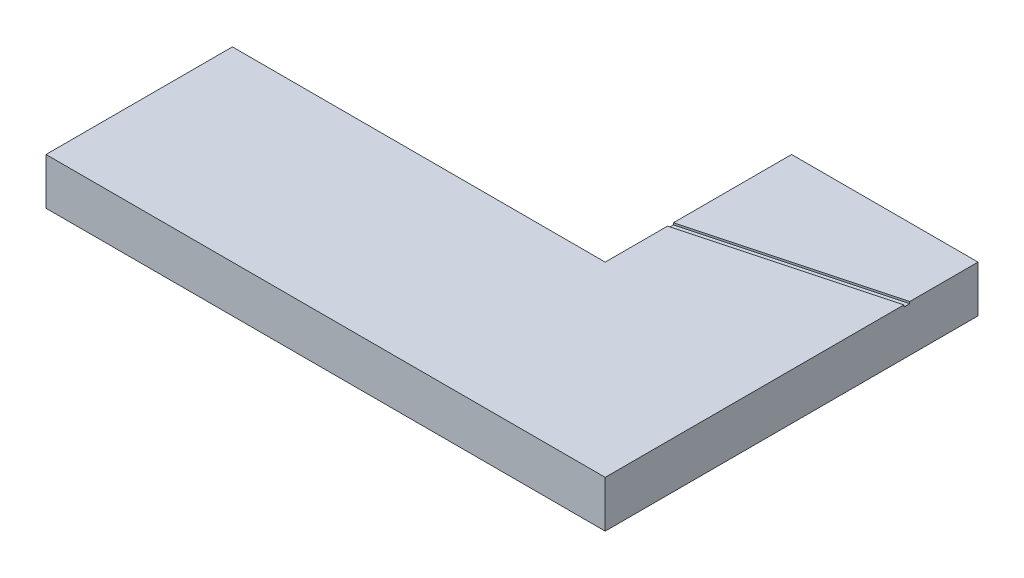
ISO-10303-21;
HEADER;
FILE_DESCRIPTION(('STEP AP214'),'2;1');
FILE_NAME('part.step','',(''),(''),'','','');
FILE_SCHEMA(('AUTOMOTIVE_DESIGN { 1 0 10303 214 1 1 1 1 }'));
ENDSEC;
DATA;
#1=APPLICATION_CONTEXT('core data for automotive mechanical design processes');
#2=APPLICATION_PROTOCOL_DEFINITION('international standard','automotive_design',2000,#1);
#3=PRODUCT_CONTEXT('',#1,'mechanical');
#4=PRODUCT('Part','Part','',(#3));
#5=PRODUCT_RELATED_PRODUCT_CATEGORY('part','',(#4));
#6=PRODUCT_DEFINITION_FORMATION('','',#4);
#7=PRODUCT_DEFINITION_CONTEXT('part definition',#1,'design');
#8=PRODUCT_DEFINITION('design','',#6,#7);
#9=PRODUCT_DEFINITION_SHAPE('','',#8);
#10=(LENGTH_UNIT() NAMED_UNIT(*) SI_UNIT(.MILLI.,.METRE.));
#11=(NAMED_UNIT(*) PLANE_ANGLE_UNIT() SI_UNIT($,.RADIAN.));
#12=(NAMED_UNIT(*) SI_UNIT($,.STERADIAN.) SOLID_ANGLE_UNIT());
#13=UNCERTAINTY_MEASURE_WITH_UNIT(LENGTH_MEASURE(1.E-05),#10,'distance_accuracy_value','');
#14=(GEOMETRIC_REPRESENTATION_CONTEXT(3) GLOBAL_UNCERTAINTY_ASSIGNED_CONTEXT((#13)) GLOBAL_UNIT_ASSIGNED_CONTEXT((#10,
#11,#12)) REPRESENTATION_CONTEXT('',''));
#15=CARTESIAN_POINT('',(0.,0.,0.));
#16=DIRECTION('',(0.,0.,1.));
#17=DIRECTION('',(1.,0.,0.));
#18=AXIS2_PLACEMENT_3D('',#15,#16,#17);
#19=CARTESIAN_POINT('',(0.,25.,0.));
#20=DIRECTION('',(0.,1.,0.));
#21=DIRECTION('',(0.,0.,1.));
#22=AXIS2_PLACEMENT_3D('',#19,#20,#21);
#23=PLANE('',#22);
#24=DIRECTION('',(0.965925826289068,0.,-0.258819045102521));
#25=VECTOR('',#24,1.);
#26=CARTESIAN_POINT('',(-8.36177143234624,25.,-31.2065558267941));
#27=LINE('',#26,#25);
#28=CARTESIAN_POINT('',(0.,25.,-33.4470857293849));
#29=VERTEX_POINT('',#28);
#30=CARTESIAN_POINT('',(99.9999999999999,25.,-60.2420049724972));
#31=VERTEX_POINT('',#30);
#32=EDGE_CURVE('E41',#29,#31,#27,.T.);
#33=ORIENTED_EDGE('',*,*,#32,.F.);
#34=DIRECTION('',(0.,0.,1.));
#35=VECTOR('',#34,1.);
#36=CARTESIAN_POINT('',(0.,25.,0.));
#37=LINE('',#36,#35);
#38=CARTESIAN_POINT('',(0.,25.,0.));
#39=VERTEX_POINT('',#38);
#40=EDGE_CURVE('E57',#29,#39,#37,.T.);
#41=ORIENTED_EDGE('',*,*,#40,.T.);
#42=DIRECTION('',(-1.,0.,0.));
#43=VECTOR('',#42,1.);
#44=CARTESIAN_POINT('',(-200.,25.,0.));
#45=LINE('',#44,#43);
#46=CARTESIAN_POINT('',(-200.,25.,0.));
#47=VERTEX_POINT('',#46);
#48=EDGE_CURVE('E149',#39,#47,#45,.T.);
#49=ORIENTED_EDGE('',*,*,#48,.T.);
#50=DIRECTION('',(0.,0.,1.));
#51=VECTOR('',#50,1.);
#52=CARTESIAN_POINT('',(-200.,25.,100.));
#53=LINE('',#52,#51);
#54=CARTESIAN_POINT('',(-200.,25.,100.));
#55=VERTEX_POINT('',#54);
#56=EDGE_CURVE('E94',#47,#55,#53,.T.);
#57=ORIENTED_EDGE('',*,*,#56,.T.);
#58=DIRECTION('',(1.,0.,0.));
#59=VECTOR('',#58,1.);
#60=CARTESIAN_POINT('',(99.9999999999999,25.,100.));
#61=LINE('',#60,#59);
#62=CARTESIAN_POINT('',(99.9999999999999,25.,100.));
#63=VERTEX_POINT('',#62);
#64=EDGE_CURVE('E114',#55,#63,#61,.T.);
#65=ORIENTED_EDGE('',*,*,#64,.T.);
#66=DIRECTION('',(0.,0.,-1.));
#67=VECTOR('',#66,1.);
#68=CARTESIAN_POINT('',(99.9999999999999,25.,-100.));
#69=LINE('',#68,#67);
#70=EDGE_CURVE('E113',#63,#31,#69,.T.);
#71=ORIENTED_EDGE('',*,*,#70,.T.);
#72=EDGE_LOOP('',(#33,#41,#49,#57,#65,#71));
#73=FACE_BOUND('',#72,.T.);
#74=ADVANCED_FACE('F33',(#73),#23,.T.);
#75=CARTESIAN_POINT('',(-200.,25.,0.));
#76=DIRECTION('',(0.,0.,1.));
#77=DIRECTION('',(1.,0.,0.));
#78=AXIS2_PLACEMENT_3D('',#75,#76,#77);
#79=PLANE('',#78);
#80=DIRECTION('',(-1.,0.,0.));
#81=VECTOR('',#80,1.);
#82=CARTESIAN_POINT('',(-200.,0.,0.));
#83=LINE('',#82,#81);
#84=CARTESIAN_POINT('',(0.,0.,0.));
#85=VERTEX_POINT('',#84);
#86=CARTESIAN_POINT('',(-200.,0.,0.));
#87=VERTEX_POINT('',#86);
#88=EDGE_CURVE('E137',#85,#87,#83,.T.);
#89=ORIENTED_EDGE('',*,*,#88,.T.);
#90=DIRECTION('',(0.,-1.,0.));
#91=VECTOR('',#90,1.);
#92=CARTESIAN_POINT('',(-200.,25.,0.));
#93=LINE('',#92,#91);
#94=EDGE_CURVE('E156',#47,#87,#93,.T.);
#95=ORIENTED_EDGE('',*,*,#94,.F.);
#96=ORIENTED_EDGE('',*,*,#48,.F.);
#97=DIRECTION('',(0.,-1.,0.));
#98=VECTOR('',#97,1.);
#99=CARTESIAN_POINT('',(0.,25.,0.));
#100=LINE('',#99,#98);
#101=EDGE_CURVE('E136',#39,#85,#100,.T.);
#102=ORIENTED_EDGE('',*,*,#101,.T.);
#103=EDGE_LOOP('',(#89,#95,#96,#102));
#104=FACE_BOUND('',#103,.T.);
#105=ADVANCED_FACE('F35',(#104),#79,.F.);
#106=CARTESIAN_POINT('',(-200.,25.,100.));
#107=DIRECTION('',(1.,0.,0.));
#108=DIRECTION('',(0.,0.,-1.));
#109=AXIS2_PLACEMENT_3D('',#106,#107,#108);
#110=PLANE('',#109);
#111=DIRECTION('',(0.,0.,1.));
#112=VECTOR('',#111,1.);
#113=CARTESIAN_POINT('',(-200.,0.,100.));
#114=LINE('',#113,#112);
#115=CARTESIAN_POINT('',(-200.,0.,100.));
#116=VERTEX_POINT('',#115);
#117=EDGE_CURVE('E140',#87,#116,#114,.T.);
#118=ORIENTED_EDGE('',*,*,#117,.T.);
#119=DIRECTION('',(0.,-1.,0.));
#120=VECTOR('',#119,1.);
#121=CARTESIAN_POINT('',(-200.,25.,100.));
#122=LINE('',#121,#120);
#123=EDGE_CURVE('E153',#55,#116,#122,.T.);
#124=ORIENTED_EDGE('',*,*,#123,.F.);
#125=ORIENTED_EDGE('',*,*,#56,.F.);
#126=ORIENTED_EDGE('',*,*,#94,.T.);
#127=EDGE_LOOP('',(#118,#124,#125,#126));
#128=FACE_BOUND('',#127,.T.);
#129=ADVANCED_FACE('F211',(#128),#110,.F.);
#130=CARTESIAN_POINT('',(99.9999999999999,25.,100.));
#131=DIRECTION('',(0.,0.,-1.));
#132=DIRECTION('',(-1.,0.,0.));
#133=AXIS2_PLACEMENT_3D('',#130,#131,#132);
#134=PLANE('',#133);
#135=DIRECTION('',(1.,0.,0.));
#136=VECTOR('',#135,1.);
#137=CARTESIAN_POINT('',(99.9999999999999,0.,100.));
#138=LINE('',#137,#136);
#139=CARTESIAN_POINT('',(99.9999999999999,0.,100.));
#140=VERTEX_POINT('',#139);
#141=EDGE_CURVE('E143',#116,#140,#138,.T.);
#142=ORIENTED_EDGE('',*,*,#141,.T.);
#143=DIRECTION('',(0.,-1.,0.));
#144=VECTOR('',#143,1.);
#145=CARTESIAN_POINT('',(99.9999999999999,25.,100.));
#146=LINE('',#145,#144);
#147=EDGE_CURVE('E125',#63,#140,#146,.T.);
#148=ORIENTED_EDGE('',*,*,#147,.F.);
#149=ORIENTED_EDGE('',*,*,#64,.F.);
#150=ORIENTED_EDGE('',*,*,#123,.T.);
#151=EDGE_LOOP('',(#142,#148,#149,#150));
#152=FACE_BOUND('',#151,.T.);
#153=ADVANCED_FACE('F179',(#152),#134,.F.);
#154=CARTESIAN_POINT('',(99.9999999999999,25.,-100.));
#155=DIRECTION('',(-1.,0.,0.));
#156=DIRECTION('',(0.,0.,1.));
#157=AXIS2_PLACEMENT_3D('',#154,#155,#156);
#158=PLANE('',#157);
#159=DIRECTION('',(0.,0.,-1.));
#160=VECTOR('',#159,1.);
#161=CARTESIAN_POINT('',(99.9999999999999,24.,-100.));
#162=LINE('',#161,#160);
#163=CARTESIAN_POINT('',(99.9999999999999,24.,-60.2420049724972));
#164=VERTEX_POINT('',#163);
#165=CARTESIAN_POINT('',(99.9999999999999,24.,-63.3478335137275));
#166=VERTEX_POINT('',#165);
#167=EDGE_CURVE('E141',#164,#166,#162,.T.);
#168=ORIENTED_EDGE('',*,*,#167,.F.);
#169=DIRECTION('',(0.,1.,0.));
#170=VECTOR('',#169,1.);
#171=CARTESIAN_POINT('',(99.9999999999999,25.,-60.2420049724972));
#172=LINE('',#171,#170);
#173=EDGE_CURVE('E166',#164,#31,#172,.T.);
#174=ORIENTED_EDGE('',*,*,#173,.T.);
#175=ORIENTED_EDGE('',*,*,#70,.F.);
#176=ORIENTED_EDGE('',*,*,#147,.T.);
#177=DIRECTION('',(0.,0.,-1.));
#178=VECTOR('',#177,1.);
#179=CARTESIAN_POINT('',(99.9999999999999,0.,-100.));
#180=LINE('',#179,#178);
#181=CARTESIAN_POINT('',(99.9999999999999,0.,-100.));
#182=VERTEX_POINT('',#181);
#183=EDGE_CURVE('E122',#140,#182,#180,.T.);
#184=ORIENTED_EDGE('',*,*,#183,.T.);
#185=DIRECTION('',(0.,-1.,0.));
#186=VECTOR('',#185,1.);
#187=CARTESIAN_POINT('',(99.9999999999999,25.,-100.));
#188=LINE('',#187,#186);
#189=CARTESIAN_POINT('',(99.9999999999999,25.,-100.));
#190=VERTEX_POINT('',#189);
#191=EDGE_CURVE('E117',#190,#182,#188,.T.);
#192=ORIENTED_EDGE('',*,*,#191,.F.);
#193=CARTESIAN_POINT('',(99.9999999999999,25.,-63.3478335137275));
#194=VERTEX_POINT('',#193);
#195=EDGE_CURVE('E104',#194,#190,#69,.T.);
#196=ORIENTED_EDGE('',*,*,#195,.F.);
#197=DIRECTION('',(0.,-1.,0.));
#198=VECTOR('',#197,1.);
#199=CARTESIAN_POINT('',(99.9999999999999,25.,-63.3478335137275));
#200=LINE('',#199,#198);
#201=EDGE_CURVE('E48',#194,#166,#200,.T.);
#202=ORIENTED_EDGE('',*,*,#201,.T.);
#203=EDGE_LOOP('',(#168,#174,#175,#176,#184,#192,#196,#202));
#204=FACE_BOUND('',#203,.T.);
#205=ADVANCED_FACE('F119',(#204),#158,.F.);
#206=CARTESIAN_POINT('',(0.,25.,-100.));
#207=DIRECTION('',(0.,0.,1.));
#208=DIRECTION('',(1.,0.,0.));
#209=AXIS2_PLACEMENT_3D('',#206,#207,#208);
#210=PLANE('',#209);
#211=DIRECTION('',(-1.,0.,0.));
#212=VECTOR('',#211,1.);
#213=CARTESIAN_POINT('',(0.,0.,-100.));
#214=LINE('',#213,#212);
#215=CARTESIAN_POINT('',(0.,0.,-100.));
#216=VERTEX_POINT('',#215);
#217=EDGE_CURVE('E146',#182,#216,#214,.T.);
#218=ORIENTED_EDGE('',*,*,#217,.T.);
#219=DIRECTION('',(0.,-1.,0.));
#220=VECTOR('',#219,1.);
#221=CARTESIAN_POINT('',(0.,25.,-100.));
#222=LINE('',#221,#220);
#223=CARTESIAN_POINT('',(0.,25.,-100.));
#224=VERTEX_POINT('',#223);
#225=EDGE_CURVE('E126',#224,#216,#222,.T.);
#226=ORIENTED_EDGE('',*,*,#225,.F.);
#227=DIRECTION('',(-1.,0.,0.));
#228=VECTOR('',#227,1.);
#229=CARTESIAN_POINT('',(0.,25.,-100.));
#230=LINE('',#229,#228);
#231=EDGE_CURVE('E109',#190,#224,#230,.T.);
#232=ORIENTED_EDGE('',*,*,#231,.F.);
#233=ORIENTED_EDGE('',*,*,#191,.T.);
#234=EDGE_LOOP('',(#218,#226,#232,#233));
#235=FACE_BOUND('',#234,.T.);
#236=ADVANCED_FACE('F128',(#235),#210,.F.);
#237=CARTESIAN_POINT('',(0.,25.,0.));
#238=DIRECTION('',(1.,0.,0.));
#239=DIRECTION('',(0.,0.,-1.));
#240=AXIS2_PLACEMENT_3D('',#237,#238,#239);
#241=PLANE('',#240);
#242=ORIENTED_EDGE('',*,*,#40,.F.);
#243=DIRECTION('',(0.,-1.,0.));
#244=VECTOR('',#243,1.);
#245=CARTESIAN_POINT('',(0.,25.,-33.4470857293849));
#246=LINE('',#245,#244);
#247=CARTESIAN_POINT('',(0.,24.,-33.4470857293849));
#248=VERTEX_POINT('',#247);
#249=EDGE_CURVE('E170',#29,#248,#246,.T.);
#250=ORIENTED_EDGE('',*,*,#249,.T.);
#251=DIRECTION('',(0.,0.,1.));
#252=VECTOR('',#251,1.);
#253=CARTESIAN_POINT('',(0.,24.,0.));
#254=LINE('',#253,#252);
#255=CARTESIAN_POINT('',(0.,24.,-36.5529142706151));
#256=VERTEX_POINT('',#255);
#257=EDGE_CURVE('E11',#256,#248,#254,.T.);
#258=ORIENTED_EDGE('',*,*,#257,.F.);
#259=DIRECTION('',(0.,1.,0.));
#260=VECTOR('',#259,1.);
#261=CARTESIAN_POINT('',(0.,25.,-36.5529142706151));
#262=LINE('',#261,#260);
#263=CARTESIAN_POINT('',(0.,25.,-36.5529142706151));
#264=VERTEX_POINT('',#263);
#265=EDGE_CURVE('E189',#256,#264,#262,.T.);
#266=ORIENTED_EDGE('',*,*,#265,.T.);
#267=EDGE_CURVE('E131',#224,#264,#37,.T.);
#268=ORIENTED_EDGE('',*,*,#267,.F.);
#269=ORIENTED_EDGE('',*,*,#225,.T.);
#270=DIRECTION('',(0.,0.,1.));
#271=VECTOR('',#270,1.);
#272=CARTESIAN_POINT('',(0.,0.,0.));
#273=LINE('',#272,#271);
#274=EDGE_CURVE('E85',#216,#85,#273,.T.);
#275=ORIENTED_EDGE('',*,*,#274,.T.);
#276=ORIENTED_EDGE('',*,*,#101,.F.);
#277=EDGE_LOOP('',(#242,#250,#258,#266,#268,#269,#275,#276));
#278=FACE_BOUND('',#277,.T.);
#279=ADVANCED_FACE('F184',(#278),#241,.F.);
#280=DIRECTION('',(-0.965925826289068,0.,0.258819045102522));
#281=VECTOR('',#280,1.);
#282=CARTESIAN_POINT('',(-9.13822856765382,25.,-34.1043333056613));
#283=LINE('',#282,#281);
#284=EDGE_CURVE('E111',#194,#264,#283,.T.);
#285=ORIENTED_EDGE('',*,*,#284,.F.);
#286=ORIENTED_EDGE('',*,*,#195,.T.);
#287=ORIENTED_EDGE('',*,*,#231,.T.);
#288=ORIENTED_EDGE('',*,*,#267,.T.);
#289=EDGE_LOOP('',(#285,#286,#287,#288));
#290=FACE_BOUND('',#289,.T.);
#291=ADVANCED_FACE('F106',(#290),#23,.T.);
#292=CARTESIAN_POINT('',(0.,0.,0.));
#293=DIRECTION('',(0.,1.,0.));
#294=DIRECTION('',(0.,0.,1.));
#295=AXIS2_PLACEMENT_3D('',#292,#293,#294);
#296=PLANE('',#295);
#297=ORIENTED_EDGE('',*,*,#88,.F.);
#298=ORIENTED_EDGE('',*,*,#274,.F.);
#299=ORIENTED_EDGE('',*,*,#217,.F.);
#300=ORIENTED_EDGE('',*,*,#183,.F.);
#301=ORIENTED_EDGE('',*,*,#141,.F.);
#302=ORIENTED_EDGE('',*,*,#117,.F.);
#303=EDGE_LOOP('',(#297,#298,#299,#300,#301,#302));
#304=FACE_BOUND('',#303,.T.);
#305=ADVANCED_FACE('F183',(#304),#296,.F.);
#306=CARTESIAN_POINT('',(0.,24.,0.));
#307=DIRECTION('',(0.,1.,0.));
#308=DIRECTION('',(0.,0.,1.));
#309=AXIS2_PLACEMENT_3D('',#306,#307,#308);
#310=PLANE('',#309);
#311=ORIENTED_EDGE('',*,*,#167,.T.);
#312=DIRECTION('',(-0.965925826289068,0.,0.258819045102522));
#313=VECTOR('',#312,1.);
#314=CARTESIAN_POINT('',(149.637721509235,24.,-76.6482209062482));
#315=LINE('',#314,#313);
#316=EDGE_CURVE('E200',#166,#256,#315,.T.);
#317=ORIENTED_EDGE('',*,*,#316,.T.);
#318=ORIENTED_EDGE('',*,*,#257,.T.);
#319=DIRECTION('',(0.965925826289068,0.,-0.258819045102521));
#320=VECTOR('',#319,1.);
#321=CARTESIAN_POINT('',(150.414178644543,24.,-73.7504434273809));
#322=LINE('',#321,#320);
#323=EDGE_CURVE('E199',#248,#164,#322,.T.);
#324=ORIENTED_EDGE('',*,*,#323,.T.);
#325=EDGE_LOOP('',(#311,#317,#318,#324));
#326=FACE_BOUND('',#325,.T.);
#327=ADVANCED_FACE('F198',(#326),#310,.T.);
#328=CARTESIAN_POINT('',(150.414178644543,24.,-73.7504434273809));
#329=DIRECTION('',(0.258819045102521,0.,0.965925826289068));
#330=DIRECTION('',(0.965925826289068,0.,-0.258819045102521));
#331=AXIS2_PLACEMENT_3D('',#328,#329,#330);
#332=PLANE('',#331);
#333=ORIENTED_EDGE('',*,*,#323,.F.);
#334=ORIENTED_EDGE('',*,*,#249,.F.);
#335=ORIENTED_EDGE('',*,*,#32,.T.);
#336=ORIENTED_EDGE('',*,*,#173,.F.);
#337=EDGE_LOOP('',(#333,#334,#335,#336));
#338=FACE_BOUND('',#337,.T.);
#339=ADVANCED_FACE('F165',(#338),#332,.F.);
#340=CARTESIAN_POINT('',(149.637721509235,24.,-76.6482209062482));
#341=DIRECTION('',(-0.258819045102522,0.,-0.965925826289068));
#342=DIRECTION('',(-0.965925826289068,0.,0.258819045102522));
#343=AXIS2_PLACEMENT_3D('',#340,#341,#342);
#344=PLANE('',#343);
#345=ORIENTED_EDGE('',*,*,#284,.T.);
#346=ORIENTED_EDGE('',*,*,#265,.F.);
#347=ORIENTED_EDGE('',*,*,#316,.F.);
#348=ORIENTED_EDGE('',*,*,#201,.F.);
#349=EDGE_LOOP('',(#345,#346,#347,#348));
#350=FACE_BOUND('',#349,.T.);
#351=ADVANCED_FACE('F275',(#350),#344,.F.);
#352=CLOSED_SHELL('',(#74,#105,#129,#153,#205,#236,#279,#291,#305,#327,#339,#351));
#353=MANIFOLD_SOLID_BREP('B2',#352);
#354=ADVANCED_BREP_SHAPE_REPRESENTATION('',(#18,#353),#14);
#355=SHAPE_DEFINITION_REPRESENTATION(#9,#354);
ENDSEC;
END-ISO-10303-21;
